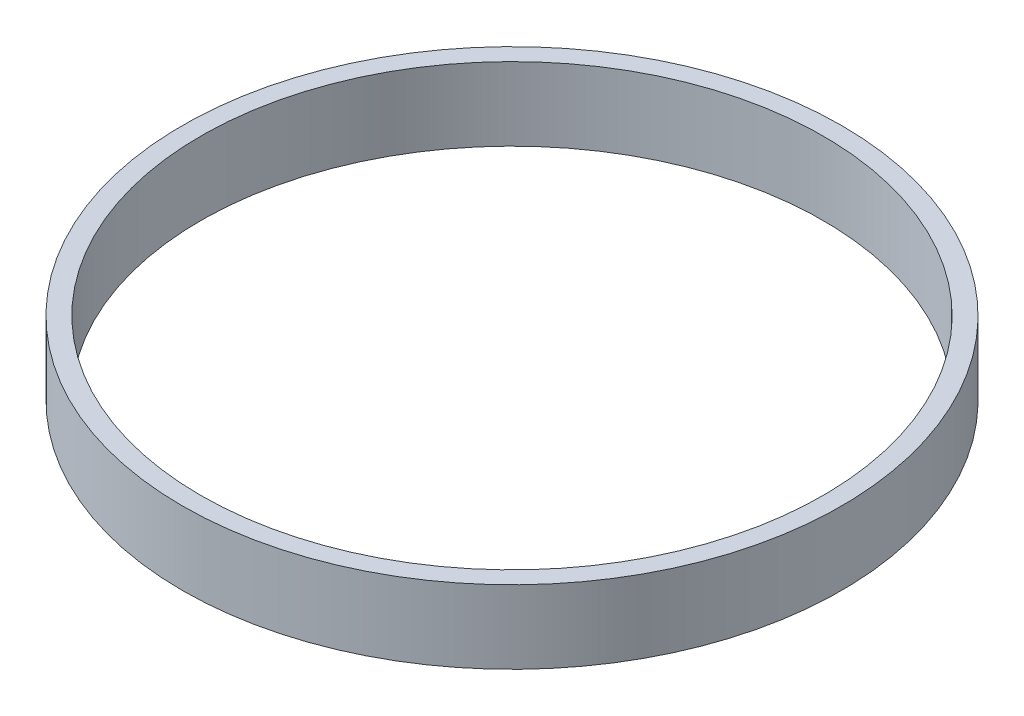
ISO-10303-21;
HEADER;
FILE_DESCRIPTION(('STEP AP214'),'2;1');
FILE_NAME('part.step','',(''),(''),'','','');
FILE_SCHEMA(('AUTOMOTIVE_DESIGN { 1 0 10303 214 1 1 1 1 }'));
ENDSEC;
DATA;
#1=APPLICATION_CONTEXT('core data for automotive mechanical design processes');
#2=APPLICATION_PROTOCOL_DEFINITION('international standard','automotive_design',2000,#1);
#3=PRODUCT_CONTEXT('',#1,'mechanical');
#4=PRODUCT('Part','Part','',(#3));
#5=PRODUCT_RELATED_PRODUCT_CATEGORY('part','',(#4));
#6=PRODUCT_DEFINITION_FORMATION('','',#4);
#7=PRODUCT_DEFINITION_CONTEXT('part definition',#1,'design');
#8=PRODUCT_DEFINITION('design','',#6,#7);
#9=PRODUCT_DEFINITION_SHAPE('','',#8);
#10=(LENGTH_UNIT() NAMED_UNIT(*) SI_UNIT(.MILLI.,.METRE.));
#11=(NAMED_UNIT(*) PLANE_ANGLE_UNIT() SI_UNIT($,.RADIAN.));
#12=(NAMED_UNIT(*) SI_UNIT($,.STERADIAN.) SOLID_ANGLE_UNIT());
#13=UNCERTAINTY_MEASURE_WITH_UNIT(LENGTH_MEASURE(1.E-05),#10,'distance_accuracy_value','');
#14=(GEOMETRIC_REPRESENTATION_CONTEXT(3) GLOBAL_UNCERTAINTY_ASSIGNED_CONTEXT((#13)) GLOBAL_UNIT_ASSIGNED_CONTEXT((#10,
#11,#12)) REPRESENTATION_CONTEXT('',''));
#15=CARTESIAN_POINT('',(0.,0.,0.));
#16=DIRECTION('',(0.,0.,1.));
#17=DIRECTION('',(1.,0.,0.));
#18=AXIS2_PLACEMENT_3D('',#15,#16,#17);
#19=CARTESIAN_POINT('',(0.,10.,0.));
#20=DIRECTION('',(0.,-1.,0.));
#21=DIRECTION('',(0.,0.,-1.));
#22=AXIS2_PLACEMENT_3D('',#19,#20,#21);
#23=CYLINDRICAL_SURFACE('',#22,45.);
#24=CARTESIAN_POINT('',(0.,10.,0.));
#25=DIRECTION('',(0.,1.,0.));
#26=DIRECTION('',(0.,0.,1.));
#27=AXIS2_PLACEMENT_3D('',#24,#25,#26);
#28=CIRCLE('',#27,45.);
#29=CARTESIAN_POINT('',(0.,10.,45.));
#30=VERTEX_POINT('',#29);
#31=EDGE_CURVE('E10',#30,#30,#28,.T.);
#32=ORIENTED_EDGE('',*,*,#31,.F.);
#33=EDGE_LOOP('',(#32));
#34=FACE_BOUND('',#33,.T.);
#35=CARTESIAN_POINT('',(0.,0.,0.));
#36=DIRECTION('',(0.,1.,0.));
#37=DIRECTION('',(0.,0.,1.));
#38=AXIS2_PLACEMENT_3D('',#35,#36,#37);
#39=CIRCLE('',#38,45.);
#40=CARTESIAN_POINT('',(0.,0.,45.));
#41=VERTEX_POINT('',#40);
#42=EDGE_CURVE('E39',#41,#41,#39,.T.);
#43=ORIENTED_EDGE('',*,*,#42,.T.);
#44=EDGE_LOOP('',(#43));
#45=FACE_BOUND('',#44,.T.);
#46=ADVANCED_FACE('F32',(#34,#45),#23,.T.);
#47=CARTESIAN_POINT('',(0.,10.,0.));
#48=DIRECTION('',(0.,1.,0.));
#49=DIRECTION('',(0.,0.,1.));
#50=AXIS2_PLACEMENT_3D('',#47,#48,#49);
#51=PLANE('',#50);
#52=CARTESIAN_POINT('',(0.,10.,0.));
#53=DIRECTION('',(0.,1.,0.));
#54=DIRECTION('',(0.,0.,1.));
#55=AXIS2_PLACEMENT_3D('',#52,#53,#54);
#56=CIRCLE('',#55,42.5);
#57=CARTESIAN_POINT('',(0.,10.,42.5));
#58=VERTEX_POINT('',#57);
#59=EDGE_CURVE('E45',#58,#58,#56,.T.);
#60=ORIENTED_EDGE('',*,*,#59,.F.);
#61=EDGE_LOOP('',(#60));
#62=FACE_BOUND('',#61,.T.);
#63=ORIENTED_EDGE('',*,*,#31,.T.);
#64=EDGE_LOOP('',(#63));
#65=FACE_BOUND('',#64,.T.);
#66=ADVANCED_FACE('F61',(#62,#65),#51,.T.);
#67=CARTESIAN_POINT('',(0.,0.,0.));
#68=DIRECTION('',(0.,1.,0.));
#69=DIRECTION('',(0.,0.,1.));
#70=AXIS2_PLACEMENT_3D('',#67,#68,#69);
#71=PLANE('',#70);
#72=CARTESIAN_POINT('',(0.,0.,0.));
#73=DIRECTION('',(0.,1.,0.));
#74=DIRECTION('',(0.,0.,1.));
#75=AXIS2_PLACEMENT_3D('',#72,#73,#74);
#76=CIRCLE('',#75,42.5);
#77=CARTESIAN_POINT('',(0.,0.,42.5));
#78=VERTEX_POINT('',#77);
#79=EDGE_CURVE('E35',#78,#78,#76,.T.);
#80=ORIENTED_EDGE('',*,*,#79,.T.);
#81=EDGE_LOOP('',(#80));
#82=FACE_BOUND('',#81,.T.);
#83=ORIENTED_EDGE('',*,*,#42,.F.);
#84=EDGE_LOOP('',(#83));
#85=FACE_BOUND('',#84,.T.);
#86=ADVANCED_FACE('F52',(#82,#85),#71,.F.);
#87=CARTESIAN_POINT('',(0.,-10.35,0.));
#88=DIRECTION('',(0.,1.,0.));
#89=DIRECTION('',(0.,0.,1.));
#90=AXIS2_PLACEMENT_3D('',#87,#88,#89);
#91=CYLINDRICAL_SURFACE('',#90,42.5);
#92=ORIENTED_EDGE('',*,*,#59,.T.);
#93=EDGE_LOOP('',(#92));
#94=FACE_BOUND('',#93,.T.);
#95=ORIENTED_EDGE('',*,*,#79,.F.);
#96=EDGE_LOOP('',(#95));
#97=FACE_BOUND('',#96,.T.);
#98=ADVANCED_FACE('F55',(#94,#97),#91,.F.);
#99=CLOSED_SHELL('',(#46,#66,#86,#98));
#100=MANIFOLD_SOLID_BREP('B2',#99);
#101=ADVANCED_BREP_SHAPE_REPRESENTATION('',(#18,#100),#14);
#102=SHAPE_DEFINITION_REPRESENTATION(#9,#101);
ENDSEC;
END-ISO-10303-21;
